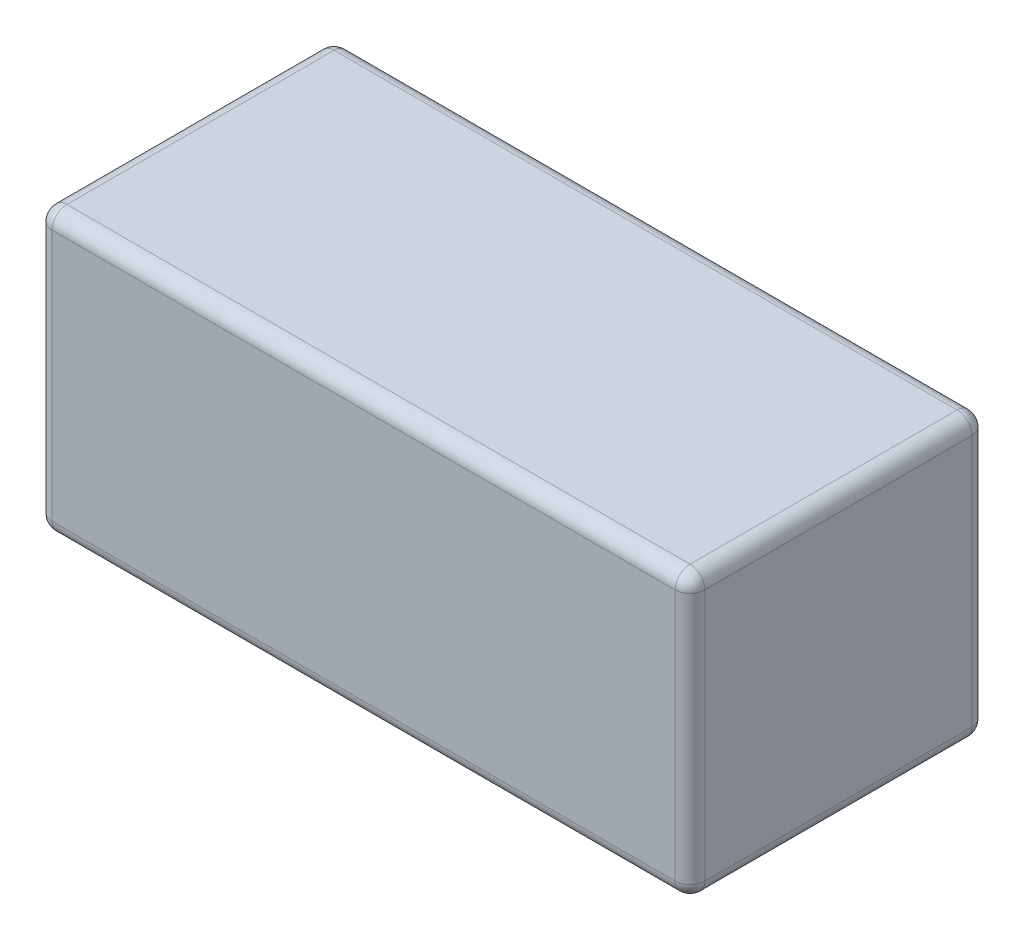
ISO-10303-21;
HEADER;
FILE_DESCRIPTION(('STEP AP214'),'2;1');
FILE_NAME('part.step','',(''),(''),'','','');
FILE_SCHEMA(('AUTOMOTIVE_DESIGN { 1 0 10303 214 1 1 1 1 }'));
ENDSEC;
DATA;
#1=APPLICATION_CONTEXT('core data for automotive mechanical design processes');
#2=APPLICATION_PROTOCOL_DEFINITION('international standard','automotive_design',2000,#1);
#3=PRODUCT_CONTEXT('',#1,'mechanical');
#4=PRODUCT('Part','Part','',(#3));
#5=PRODUCT_RELATED_PRODUCT_CATEGORY('part','',(#4));
#6=PRODUCT_DEFINITION_FORMATION('','',#4);
#7=PRODUCT_DEFINITION_CONTEXT('part definition',#1,'design');
#8=PRODUCT_DEFINITION('design','',#6,#7);
#9=PRODUCT_DEFINITION_SHAPE('','',#8);
#10=(LENGTH_UNIT() NAMED_UNIT(*) SI_UNIT(.MILLI.,.METRE.));
#11=(NAMED_UNIT(*) PLANE_ANGLE_UNIT() SI_UNIT($,.RADIAN.));
#12=(NAMED_UNIT(*) SI_UNIT($,.STERADIAN.) SOLID_ANGLE_UNIT());
#13=UNCERTAINTY_MEASURE_WITH_UNIT(LENGTH_MEASURE(1.E-05),#10,'distance_accuracy_value','');
#14=(GEOMETRIC_REPRESENTATION_CONTEXT(3) GLOBAL_UNCERTAINTY_ASSIGNED_CONTEXT((#13)) GLOBAL_UNIT_ASSIGNED_CONTEXT((#10,
#11,#12)) REPRESENTATION_CONTEXT('',''));
#15=CARTESIAN_POINT('',(0.,0.,0.));
#16=DIRECTION('',(0.,0.,1.));
#17=DIRECTION('',(1.,0.,0.));
#18=AXIS2_PLACEMENT_3D('',#15,#16,#17);
#19=CARTESIAN_POINT('',(11.,4.75,0.));
#20=DIRECTION('',(0.,1.,0.));
#21=DIRECTION('',(1.,0.,0.));
#22=AXIS2_PLACEMENT_3D('',#19,#20,#21);
#23=PLANE('',#22);
#24=DIRECTION('',(1.,0.,0.));
#25=VECTOR('',#24,1.);
#26=CARTESIAN_POINT('',(5.5,4.75,0.5));
#27=LINE('',#26,#25);
#28=CARTESIAN_POINT('',(-10.5,4.75,0.5));
#29=VERTEX_POINT('',#28);
#30=CARTESIAN_POINT('',(10.5,4.75,0.5));
#31=VERTEX_POINT('',#30);
#32=EDGE_CURVE('E280',#29,#31,#27,.T.);
#33=ORIENTED_EDGE('',*,*,#32,.F.);
#34=DIRECTION('',(0.,0.,-1.));
#35=VECTOR('',#34,1.);
#36=CARTESIAN_POINT('',(-10.5,4.75,0.));
#37=LINE('',#36,#35);
#38=CARTESIAN_POINT('',(-10.5,4.75,9.5));
#39=VERTEX_POINT('',#38);
#40=EDGE_CURVE('E11',#39,#29,#37,.T.);
#41=ORIENTED_EDGE('',*,*,#40,.F.);
#42=DIRECTION('',(-1.,0.,0.));
#43=VECTOR('',#42,1.);
#44=CARTESIAN_POINT('',(5.5,4.75,9.5));
#45=LINE('',#44,#43);
#46=CARTESIAN_POINT('',(10.5,4.75,9.5));
#47=VERTEX_POINT('',#46);
#48=EDGE_CURVE('E171',#47,#39,#45,.T.);
#49=ORIENTED_EDGE('',*,*,#48,.F.);
#50=DIRECTION('',(0.,0.,1.));
#51=VECTOR('',#50,1.);
#52=CARTESIAN_POINT('',(10.5,4.75,0.));
#53=LINE('',#52,#51);
#54=EDGE_CURVE('E183',#31,#47,#53,.T.);
#55=ORIENTED_EDGE('',*,*,#54,.F.);
#56=EDGE_LOOP('',(#33,#41,#49,#55));
#57=FACE_BOUND('',#56,.T.);
#58=ADVANCED_FACE('F17',(#57),#23,.T.);
#59=CARTESIAN_POINT('',(-10.5,4.25,0.));
#60=DIRECTION('',(0.,0.,1.));
#61=DIRECTION('',(-0.707106781186548,0.707106781186548,0.));
#62=AXIS2_PLACEMENT_3D('',#59,#60,#61);
#63=CYLINDRICAL_SURFACE('',#62,0.5);
#64=CARTESIAN_POINT('',(-10.5,4.25,0.5));
#65=DIRECTION('',(0.,0.,-1.));
#66=DIRECTION('',(-0.707106781186548,0.707106781186548,0.));
#67=AXIS2_PLACEMENT_3D('',#64,#65,#66);
#68=CIRCLE('',#67,0.5);
#69=CARTESIAN_POINT('',(-11.,4.25,0.5));
#70=VERTEX_POINT('',#69);
#71=EDGE_CURVE('E284',#70,#29,#68,.T.);
#72=ORIENTED_EDGE('',*,*,#71,.F.);
#73=DIRECTION('',(0.,0.,1.));
#74=VECTOR('',#73,1.);
#75=CARTESIAN_POINT('',(-11.,4.25,0.));
#76=LINE('',#75,#74);
#77=CARTESIAN_POINT('',(-11.,4.25,9.5));
#78=VERTEX_POINT('',#77);
#79=EDGE_CURVE('E28',#70,#78,#76,.T.);
#80=ORIENTED_EDGE('',*,*,#79,.T.);
#81=CARTESIAN_POINT('',(-10.5,4.25,9.5));
#82=DIRECTION('',(0.,0.,1.));
#83=DIRECTION('',(-0.707106781186548,0.707106781186548,0.));
#84=AXIS2_PLACEMENT_3D('',#81,#82,#83);
#85=CIRCLE('',#84,0.5);
#86=EDGE_CURVE('E166',#39,#78,#85,.T.);
#87=ORIENTED_EDGE('',*,*,#86,.F.);
#88=ORIENTED_EDGE('',*,*,#40,.T.);
#89=EDGE_LOOP('',(#72,#80,#87,#88));
#90=FACE_BOUND('',#89,.T.);
#91=ADVANCED_FACE('F349',(#90),#63,.T.);
#92=CARTESIAN_POINT('',(-11.,4.75,0.));
#93=DIRECTION('',(-1.,0.,0.));
#94=DIRECTION('',(0.,0.,1.));
#95=AXIS2_PLACEMENT_3D('',#92,#93,#94);
#96=PLANE('',#95);
#97=DIRECTION('',(0.,1.,0.));
#98=VECTOR('',#97,1.);
#99=CARTESIAN_POINT('',(-11.,2.375,0.5));
#100=LINE('',#99,#98);
#101=CARTESIAN_POINT('',(-11.,-4.25,0.5));
#102=VERTEX_POINT('',#101);
#103=EDGE_CURVE('E209',#102,#70,#100,.T.);
#104=ORIENTED_EDGE('',*,*,#103,.F.);
#105=DIRECTION('',(0.,0.,-1.));
#106=VECTOR('',#105,1.);
#107=CARTESIAN_POINT('',(-11.,-4.25,0.));
#108=LINE('',#107,#106);
#109=CARTESIAN_POINT('',(-11.,-4.25,9.5));
#110=VERTEX_POINT('',#109);
#111=EDGE_CURVE('E240',#110,#102,#108,.T.);
#112=ORIENTED_EDGE('',*,*,#111,.F.);
#113=DIRECTION('',(0.,-1.,0.));
#114=VECTOR('',#113,1.);
#115=CARTESIAN_POINT('',(-11.,2.375,9.5));
#116=LINE('',#115,#114);
#117=EDGE_CURVE('E228',#78,#110,#116,.T.);
#118=ORIENTED_EDGE('',*,*,#117,.F.);
#119=ORIENTED_EDGE('',*,*,#79,.F.);
#120=EDGE_LOOP('',(#104,#112,#118,#119));
#121=FACE_BOUND('',#120,.T.);
#122=ADVANCED_FACE('F369',(#121),#96,.T.);
#123=CARTESIAN_POINT('',(0.,0.,10.));
#124=DIRECTION('',(0.,0.,1.));
#125=DIRECTION('',(1.,0.,0.));
#126=AXIS2_PLACEMENT_3D('',#123,#124,#125);
#127=PLANE('',#126);
#128=DIRECTION('',(0.,1.,0.));
#129=VECTOR('',#128,1.);
#130=CARTESIAN_POINT('',(-10.5,2.375,10.));
#131=LINE('',#130,#129);
#132=CARTESIAN_POINT('',(-10.5,-4.25,10.));
#133=VERTEX_POINT('',#132);
#134=CARTESIAN_POINT('',(-10.5,4.25,10.));
#135=VERTEX_POINT('',#134);
#136=EDGE_CURVE('E172',#133,#135,#131,.T.);
#137=ORIENTED_EDGE('',*,*,#136,.F.);
#138=DIRECTION('',(-1.,0.,0.));
#139=VECTOR('',#138,1.);
#140=CARTESIAN_POINT('',(-5.5,-4.25,10.));
#141=LINE('',#140,#139);
#142=CARTESIAN_POINT('',(10.5,-4.25,10.));
#143=VERTEX_POINT('',#142);
#144=EDGE_CURVE('E21',#143,#133,#141,.T.);
#145=ORIENTED_EDGE('',*,*,#144,.F.);
#146=DIRECTION('',(0.,-1.,0.));
#147=VECTOR('',#146,1.);
#148=CARTESIAN_POINT('',(10.5,-2.375,10.));
#149=LINE('',#148,#147);
#150=CARTESIAN_POINT('',(10.5,4.25,10.));
#151=VERTEX_POINT('',#150);
#152=EDGE_CURVE('E133',#151,#143,#149,.T.);
#153=ORIENTED_EDGE('',*,*,#152,.F.);
#154=DIRECTION('',(1.,0.,0.));
#155=VECTOR('',#154,1.);
#156=CARTESIAN_POINT('',(5.5,4.25,10.));
#157=LINE('',#156,#155);
#158=EDGE_CURVE('E137',#135,#151,#157,.T.);
#159=ORIENTED_EDGE('',*,*,#158,.F.);
#160=EDGE_LOOP('',(#137,#145,#153,#159));
#161=FACE_BOUND('',#160,.T.);
#162=ADVANCED_FACE('F135',(#161),#127,.T.);
#163=CARTESIAN_POINT('',(10.5,4.25,0.));
#164=DIRECTION('',(0.,0.,1.));
#165=DIRECTION('',(0.707106781186548,0.707106781186548,0.));
#166=AXIS2_PLACEMENT_3D('',#163,#164,#165);
#167=CYLINDRICAL_SURFACE('',#166,0.5);
#168=CARTESIAN_POINT('',(10.5,4.25,0.5));
#169=DIRECTION('',(0.,0.,-1.));
#170=DIRECTION('',(0.707106781186548,0.707106781186548,0.));
#171=AXIS2_PLACEMENT_3D('',#168,#169,#170);
#172=CIRCLE('',#171,0.5);
#173=CARTESIAN_POINT('',(11.,4.25,0.5));
#174=VERTEX_POINT('',#173);
#175=EDGE_CURVE('E217',#31,#174,#172,.T.);
#176=ORIENTED_EDGE('',*,*,#175,.F.);
#177=ORIENTED_EDGE('',*,*,#54,.T.);
#178=CARTESIAN_POINT('',(10.5,4.25,9.5));
#179=DIRECTION('',(0.,0.,1.));
#180=DIRECTION('',(0.707106781186548,0.707106781186548,0.));
#181=AXIS2_PLACEMENT_3D('',#178,#179,#180);
#182=CIRCLE('',#181,0.5);
#183=CARTESIAN_POINT('',(11.,4.25,9.5));
#184=VERTEX_POINT('',#183);
#185=EDGE_CURVE('E142',#184,#47,#182,.T.);
#186=ORIENTED_EDGE('',*,*,#185,.F.);
#187=DIRECTION('',(0.,0.,-1.));
#188=VECTOR('',#187,1.);
#189=CARTESIAN_POINT('',(11.,4.25,0.));
#190=LINE('',#189,#188);
#191=EDGE_CURVE('E197',#184,#174,#190,.T.);
#192=ORIENTED_EDGE('',*,*,#191,.T.);
#193=EDGE_LOOP('',(#176,#177,#186,#192));
#194=FACE_BOUND('',#193,.T.);
#195=ADVANCED_FACE('F352',(#194),#167,.T.);
#196=CARTESIAN_POINT('',(-10.5,-4.25,9.5));
#197=DIRECTION('',(0.408248290463863,-0.816496580927726,-0.408248290463863));
#198=DIRECTION('',(-0.577350269189626,-0.577350269189626,0.577350269189626));
#199=AXIS2_PLACEMENT_3D('',#196,#197,#198);
#200=SPHERICAL_SURFACE('',#199,0.5);
#201=CARTESIAN_POINT('',(-10.5,-4.25,9.5));
#202=DIRECTION('',(0.,1.,0.));
#203=DIRECTION('',(-1.,0.,0.));
#204=AXIS2_PLACEMENT_3D('',#201,#202,#203);
#205=CIRCLE('',#204,0.5);
#206=EDGE_CURVE('E180',#110,#133,#205,.T.);
#207=ORIENTED_EDGE('',*,*,#206,.F.);
#208=CARTESIAN_POINT('',(-10.5,-4.25,9.5));
#209=DIRECTION('',(0.,0.,1.));
#210=DIRECTION('',(-0.707106781186548,-0.707106781186548,0.));
#211=AXIS2_PLACEMENT_3D('',#208,#209,#210);
#212=CIRCLE('',#211,0.5);
#213=CARTESIAN_POINT('',(-10.5,-4.75,9.5));
#214=VERTEX_POINT('',#213);
#215=EDGE_CURVE('E216',#110,#214,#212,.T.);
#216=ORIENTED_EDGE('',*,*,#215,.T.);
#217=CARTESIAN_POINT('',(-10.5,-4.25,9.5));
#218=DIRECTION('',(1.,0.,0.));
#219=DIRECTION('',(0.,0.,1.));
#220=AXIS2_PLACEMENT_3D('',#217,#218,#219);
#221=CIRCLE('',#220,0.5);
#222=EDGE_CURVE('E255',#133,#214,#221,.T.);
#223=ORIENTED_EDGE('',*,*,#222,.F.);
#224=EDGE_LOOP('',(#207,#216,#223));
#225=FACE_BOUND('',#224,.T.);
#226=ADVANCED_FACE('F415',(#225),#200,.T.);
#227=CARTESIAN_POINT('',(10.5,-4.25,9.5));
#228=DIRECTION('',(-0.408248290463863,-0.816496580927726,-0.408248290463863));
#229=DIRECTION('',(0.577350269189626,-0.577350269189626,0.577350269189626));
#230=AXIS2_PLACEMENT_3D('',#227,#228,#229);
#231=SPHERICAL_SURFACE('',#230,0.5);
#232=CARTESIAN_POINT('',(10.5,-4.25,9.5));
#233=DIRECTION('',(-1.,0.,0.));
#234=DIRECTION('',(0.,-1.,0.));
#235=AXIS2_PLACEMENT_3D('',#232,#233,#234);
#236=CIRCLE('',#235,0.5);
#237=CARTESIAN_POINT('',(10.5,-4.75,9.5));
#238=VERTEX_POINT('',#237);
#239=EDGE_CURVE('E265',#238,#143,#236,.T.);
#240=ORIENTED_EDGE('',*,*,#239,.F.);
#241=CARTESIAN_POINT('',(10.5,-4.25,9.5));
#242=DIRECTION('',(0.,0.,1.));
#243=DIRECTION('',(0.707106781186548,-0.707106781186548,0.));
#244=AXIS2_PLACEMENT_3D('',#241,#242,#243);
#245=CIRCLE('',#244,0.5);
#246=CARTESIAN_POINT('',(11.,-4.25,9.5));
#247=VERTEX_POINT('',#246);
#248=EDGE_CURVE('E193',#238,#247,#245,.T.);
#249=ORIENTED_EDGE('',*,*,#248,.T.);
#250=CARTESIAN_POINT('',(10.5,-4.25,9.5));
#251=DIRECTION('',(0.,1.,0.));
#252=DIRECTION('',(0.,0.,1.));
#253=AXIS2_PLACEMENT_3D('',#250,#251,#252);
#254=CIRCLE('',#253,0.5);
#255=EDGE_CURVE('E155',#143,#247,#254,.T.);
#256=ORIENTED_EDGE('',*,*,#255,.F.);
#257=EDGE_LOOP('',(#240,#249,#256));
#258=FACE_BOUND('',#257,.T.);
#259=ADVANCED_FACE('F410',(#258),#231,.T.);
#260=CARTESIAN_POINT('',(-5.5,-4.25,9.5));
#261=DIRECTION('',(1.,0.,0.));
#262=DIRECTION('',(0.,-0.707106781186548,0.707106781186548));
#263=AXIS2_PLACEMENT_3D('',#260,#261,#262);
#264=CYLINDRICAL_SURFACE('',#263,0.5);
#265=ORIENTED_EDGE('',*,*,#222,.T.);
#266=DIRECTION('',(1.,0.,0.));
#267=VECTOR('',#266,1.);
#268=CARTESIAN_POINT('',(-5.5,-4.75,9.5));
#269=LINE('',#268,#267);
#270=EDGE_CURVE('E239',#214,#238,#269,.T.);
#271=ORIENTED_EDGE('',*,*,#270,.T.);
#272=ORIENTED_EDGE('',*,*,#239,.T.);
#273=ORIENTED_EDGE('',*,*,#144,.T.);
#274=EDGE_LOOP('',(#265,#271,#272,#273));
#275=FACE_BOUND('',#274,.T.);
#276=ADVANCED_FACE('F406',(#275),#264,.T.);
#277=CARTESIAN_POINT('',(10.5,4.25,9.5));
#278=DIRECTION('',(0.408248290463863,-0.816496580927726,0.408248290463863));
#279=DIRECTION('',(0.577350269189626,0.577350269189626,0.577350269189626));
#280=AXIS2_PLACEMENT_3D('',#277,#278,#279);
#281=SPHERICAL_SURFACE('',#280,0.5);
#282=CARTESIAN_POINT('',(10.5,4.25,9.5));
#283=DIRECTION('',(0.,-1.,0.));
#284=DIRECTION('',(1.,0.,0.));
#285=AXIS2_PLACEMENT_3D('',#282,#283,#284);
#286=CIRCLE('',#285,0.5);
#287=EDGE_CURVE('E143',#184,#151,#286,.T.);
#288=ORIENTED_EDGE('',*,*,#287,.F.);
#289=ORIENTED_EDGE('',*,*,#185,.T.);
#290=CARTESIAN_POINT('',(10.5,4.25,9.5));
#291=DIRECTION('',(-1.,0.,0.));
#292=DIRECTION('',(0.,0.,1.));
#293=AXIS2_PLACEMENT_3D('',#290,#291,#292);
#294=CIRCLE('',#293,0.5);
#295=EDGE_CURVE('E161',#151,#47,#294,.T.);
#296=ORIENTED_EDGE('',*,*,#295,.F.);
#297=EDGE_LOOP('',(#288,#289,#296));
#298=FACE_BOUND('',#297,.T.);
#299=ADVANCED_FACE('F168',(#298),#281,.T.);
#300=CARTESIAN_POINT('',(10.5,-2.375,9.5));
#301=DIRECTION('',(0.,1.,0.));
#302=DIRECTION('',(0.707106781186548,0.,0.707106781186548));
#303=AXIS2_PLACEMENT_3D('',#300,#301,#302);
#304=CYLINDRICAL_SURFACE('',#303,0.5);
#305=ORIENTED_EDGE('',*,*,#255,.T.);
#306=DIRECTION('',(0.,1.,0.));
#307=VECTOR('',#306,1.);
#308=CARTESIAN_POINT('',(11.,-2.375,9.5));
#309=LINE('',#308,#307);
#310=EDGE_CURVE('E149',#247,#184,#309,.T.);
#311=ORIENTED_EDGE('',*,*,#310,.T.);
#312=ORIENTED_EDGE('',*,*,#287,.T.);
#313=ORIENTED_EDGE('',*,*,#152,.T.);
#314=EDGE_LOOP('',(#305,#311,#312,#313));
#315=FACE_BOUND('',#314,.T.);
#316=ADVANCED_FACE('F147',(#315),#304,.T.);
#317=CARTESIAN_POINT('',(-10.5,4.25,9.5));
#318=DIRECTION('',(-0.408248290463863,-0.816496580927726,0.408248290463863));
#319=DIRECTION('',(-0.577350269189626,0.577350269189626,0.577350269189626));
#320=AXIS2_PLACEMENT_3D('',#317,#318,#319);
#321=SPHERICAL_SURFACE('',#320,0.5);
#322=CARTESIAN_POINT('',(-10.5,4.25,9.5));
#323=DIRECTION('',(1.,0.,0.));
#324=DIRECTION('',(0.,1.,0.));
#325=AXIS2_PLACEMENT_3D('',#322,#323,#324);
#326=CIRCLE('',#325,0.5);
#327=EDGE_CURVE('E163',#39,#135,#326,.T.);
#328=ORIENTED_EDGE('',*,*,#327,.F.);
#329=ORIENTED_EDGE('',*,*,#86,.T.);
#330=CARTESIAN_POINT('',(-10.5,4.25,9.5));
#331=DIRECTION('',(0.,-1.,0.));
#332=DIRECTION('',(0.,0.,1.));
#333=AXIS2_PLACEMENT_3D('',#330,#331,#332);
#334=CIRCLE('',#333,0.5);
#335=EDGE_CURVE('E244',#135,#78,#334,.T.);
#336=ORIENTED_EDGE('',*,*,#335,.F.);
#337=EDGE_LOOP('',(#328,#329,#336));
#338=FACE_BOUND('',#337,.T.);
#339=ADVANCED_FACE('F376',(#338),#321,.T.);
#340=CARTESIAN_POINT('',(5.5,4.25,9.5));
#341=DIRECTION('',(-1.,0.,0.));
#342=DIRECTION('',(0.,0.707106781186548,0.707106781186548));
#343=AXIS2_PLACEMENT_3D('',#340,#341,#342);
#344=CYLINDRICAL_SURFACE('',#343,0.5);
#345=ORIENTED_EDGE('',*,*,#295,.T.);
#346=ORIENTED_EDGE('',*,*,#48,.T.);
#347=ORIENTED_EDGE('',*,*,#327,.T.);
#348=ORIENTED_EDGE('',*,*,#158,.T.);
#349=EDGE_LOOP('',(#345,#346,#347,#348));
#350=FACE_BOUND('',#349,.T.);
#351=ADVANCED_FACE('F159',(#350),#344,.T.);
#352=CARTESIAN_POINT('',(-10.5,2.375,9.5));
#353=DIRECTION('',(0.,-1.,0.));
#354=DIRECTION('',(-0.707106781186548,0.,0.707106781186548));
#355=AXIS2_PLACEMENT_3D('',#352,#353,#354);
#356=CYLINDRICAL_SURFACE('',#355,0.5);
#357=ORIENTED_EDGE('',*,*,#335,.T.);
#358=ORIENTED_EDGE('',*,*,#117,.T.);
#359=ORIENTED_EDGE('',*,*,#206,.T.);
#360=ORIENTED_EDGE('',*,*,#136,.T.);
#361=EDGE_LOOP('',(#357,#358,#359,#360));
#362=FACE_BOUND('',#361,.T.);
#363=ADVANCED_FACE('F374',(#362),#356,.T.);
#364=CARTESIAN_POINT('',(0.,0.,0.));
#365=DIRECTION('',(0.,0.,1.));
#366=DIRECTION('',(1.,0.,0.));
#367=AXIS2_PLACEMENT_3D('',#364,#365,#366);
#368=PLANE('',#367);
#369=DIRECTION('',(-1.,0.,0.));
#370=VECTOR('',#369,1.);
#371=CARTESIAN_POINT('',(5.5,4.25,0.));
#372=LINE('',#371,#370);
#373=CARTESIAN_POINT('',(10.5,4.25,0.));
#374=VERTEX_POINT('',#373);
#375=CARTESIAN_POINT('',(-10.5,4.25,0.));
#376=VERTEX_POINT('',#375);
#377=EDGE_CURVE('E192',#374,#376,#372,.T.);
#378=ORIENTED_EDGE('',*,*,#377,.F.);
#379=DIRECTION('',(0.,1.,0.));
#380=VECTOR('',#379,1.);
#381=CARTESIAN_POINT('',(10.5,-2.375,0.));
#382=LINE('',#381,#380);
#383=CARTESIAN_POINT('',(10.5,-4.25,0.));
#384=VERTEX_POINT('',#383);
#385=EDGE_CURVE('E288',#384,#374,#382,.T.);
#386=ORIENTED_EDGE('',*,*,#385,.F.);
#387=DIRECTION('',(1.,0.,0.));
#388=VECTOR('',#387,1.);
#389=CARTESIAN_POINT('',(-5.5,-4.25,0.));
#390=LINE('',#389,#388);
#391=CARTESIAN_POINT('',(-10.5,-4.25,0.));
#392=VERTEX_POINT('',#391);
#393=EDGE_CURVE('E219',#392,#384,#390,.T.);
#394=ORIENTED_EDGE('',*,*,#393,.F.);
#395=DIRECTION('',(0.,-1.,0.));
#396=VECTOR('',#395,1.);
#397=CARTESIAN_POINT('',(-10.5,2.375,0.));
#398=LINE('',#397,#396);
#399=EDGE_CURVE('E210',#376,#392,#398,.T.);
#400=ORIENTED_EDGE('',*,*,#399,.F.);
#401=EDGE_LOOP('',(#378,#386,#394,#400));
#402=FACE_BOUND('',#401,.T.);
#403=ADVANCED_FACE('F341',(#402),#368,.F.);
#404=CARTESIAN_POINT('',(11.,-4.75,0.));
#405=DIRECTION('',(1.,0.,0.));
#406=DIRECTION('',(0.,1.,0.));
#407=AXIS2_PLACEMENT_3D('',#404,#405,#406);
#408=PLANE('',#407);
#409=DIRECTION('',(0.,-1.,0.));
#410=VECTOR('',#409,1.);
#411=CARTESIAN_POINT('',(11.,-2.375,0.5));
#412=LINE('',#411,#410);
#413=CARTESIAN_POINT('',(11.,-4.25,0.5));
#414=VERTEX_POINT('',#413);
#415=EDGE_CURVE('E199',#174,#414,#412,.T.);
#416=ORIENTED_EDGE('',*,*,#415,.F.);
#417=ORIENTED_EDGE('',*,*,#191,.F.);
#418=ORIENTED_EDGE('',*,*,#310,.F.);
#419=DIRECTION('',(0.,0.,1.));
#420=VECTOR('',#419,1.);
#421=CARTESIAN_POINT('',(11.,-4.25,0.));
#422=LINE('',#421,#420);
#423=EDGE_CURVE('E198',#414,#247,#422,.T.);
#424=ORIENTED_EDGE('',*,*,#423,.F.);
#425=EDGE_LOOP('',(#416,#417,#418,#424));
#426=FACE_BOUND('',#425,.T.);
#427=ADVANCED_FACE('F354',(#426),#408,.T.);
#428=CARTESIAN_POINT('',(10.5,-4.25,0.));
#429=DIRECTION('',(0.,0.,1.));
#430=DIRECTION('',(0.707106781186548,-0.707106781186548,0.));
#431=AXIS2_PLACEMENT_3D('',#428,#429,#430);
#432=CYLINDRICAL_SURFACE('',#431,0.5);
#433=CARTESIAN_POINT('',(10.5,-4.25,0.5));
#434=DIRECTION('',(0.,0.,-1.));
#435=DIRECTION('',(0.707106781186548,-0.707106781186548,0.));
#436=AXIS2_PLACEMENT_3D('',#433,#434,#435);
#437=CIRCLE('',#436,0.5);
#438=CARTESIAN_POINT('',(10.5,-4.75,0.5));
#439=VERTEX_POINT('',#438);
#440=EDGE_CURVE('E203',#414,#439,#437,.T.);
#441=ORIENTED_EDGE('',*,*,#440,.F.);
#442=ORIENTED_EDGE('',*,*,#423,.T.);
#443=ORIENTED_EDGE('',*,*,#248,.F.);
#444=DIRECTION('',(0.,0.,-1.));
#445=VECTOR('',#444,1.);
#446=CARTESIAN_POINT('',(10.5,-4.75,0.));
#447=LINE('',#446,#445);
#448=EDGE_CURVE('E236',#238,#439,#447,.T.);
#449=ORIENTED_EDGE('',*,*,#448,.T.);
#450=EDGE_LOOP('',(#441,#442,#443,#449));
#451=FACE_BOUND('',#450,.T.);
#452=ADVANCED_FACE('F397',(#451),#432,.T.);
#453=CARTESIAN_POINT('',(-11.,-4.75,0.));
#454=DIRECTION('',(0.,-1.,0.));
#455=DIRECTION('',(0.,0.,-1.));
#456=AXIS2_PLACEMENT_3D('',#453,#454,#455);
#457=PLANE('',#456);
#458=DIRECTION('',(-1.,0.,0.));
#459=VECTOR('',#458,1.);
#460=CARTESIAN_POINT('',(-5.5,-4.75,0.5));
#461=LINE('',#460,#459);
#462=CARTESIAN_POINT('',(-10.5,-4.75,0.5));
#463=VERTEX_POINT('',#462);
#464=EDGE_CURVE('E231',#439,#463,#461,.T.);
#465=ORIENTED_EDGE('',*,*,#464,.F.);
#466=ORIENTED_EDGE('',*,*,#448,.F.);
#467=ORIENTED_EDGE('',*,*,#270,.F.);
#468=DIRECTION('',(0.,0.,1.));
#469=VECTOR('',#468,1.);
#470=CARTESIAN_POINT('',(-10.5,-4.75,0.));
#471=LINE('',#470,#469);
#472=EDGE_CURVE('E213',#463,#214,#471,.T.);
#473=ORIENTED_EDGE('',*,*,#472,.F.);
#474=EDGE_LOOP('',(#465,#466,#467,#473));
#475=FACE_BOUND('',#474,.T.);
#476=ADVANCED_FACE('F400',(#475),#457,.T.);
#477=CARTESIAN_POINT('',(-10.5,-4.25,0.));
#478=DIRECTION('',(0.,0.,1.));
#479=DIRECTION('',(-0.707106781186548,-0.707106781186548,0.));
#480=AXIS2_PLACEMENT_3D('',#477,#478,#479);
#481=CYLINDRICAL_SURFACE('',#480,0.5);
#482=CARTESIAN_POINT('',(-10.5,-4.25,0.5));
#483=DIRECTION('',(0.,0.,-1.));
#484=DIRECTION('',(-0.707106781186548,-0.707106781186548,0.));
#485=AXIS2_PLACEMENT_3D('',#482,#483,#484);
#486=CIRCLE('',#485,0.5);
#487=EDGE_CURVE('E235',#463,#102,#486,.T.);
#488=ORIENTED_EDGE('',*,*,#487,.F.);
#489=ORIENTED_EDGE('',*,*,#472,.T.);
#490=ORIENTED_EDGE('',*,*,#215,.F.);
#491=ORIENTED_EDGE('',*,*,#111,.T.);
#492=EDGE_LOOP('',(#488,#489,#490,#491));
#493=FACE_BOUND('',#492,.T.);
#494=ADVANCED_FACE('F423',(#493),#481,.T.);
#495=CARTESIAN_POINT('',(10.5,4.25,0.5));
#496=DIRECTION('',(0.408248290463863,-0.816496580927726,-0.408248290463863));
#497=DIRECTION('',(0.577350269189626,0.577350269189626,-0.577350269189626));
#498=AXIS2_PLACEMENT_3D('',#495,#496,#497);
#499=SPHERICAL_SURFACE('',#498,0.5);
#500=CARTESIAN_POINT('',(10.5,4.25,0.5));
#501=DIRECTION('',(-1.,0.,0.));
#502=DIRECTION('',(0.,1.,0.));
#503=AXIS2_PLACEMENT_3D('',#500,#501,#502);
#504=CIRCLE('',#503,0.5);
#505=EDGE_CURVE('E188',#31,#374,#504,.T.);
#506=ORIENTED_EDGE('',*,*,#505,.F.);
#507=ORIENTED_EDGE('',*,*,#175,.T.);
#508=CARTESIAN_POINT('',(10.5,4.25,0.5));
#509=DIRECTION('',(0.,-1.,0.));
#510=DIRECTION('',(0.,0.,-1.));
#511=AXIS2_PLACEMENT_3D('',#508,#509,#510);
#512=CIRCLE('',#511,0.5);
#513=EDGE_CURVE('E204',#374,#174,#512,.T.);
#514=ORIENTED_EDGE('',*,*,#513,.F.);
#515=EDGE_LOOP('',(#506,#507,#514));
#516=FACE_BOUND('',#515,.T.);
#517=ADVANCED_FACE('F332',(#516),#499,.T.);
#518=CARTESIAN_POINT('',(10.5,-4.25,0.5));
#519=DIRECTION('',(-0.408248290463863,-0.816496580927726,0.408248290463863));
#520=DIRECTION('',(0.577350269189626,-0.577350269189626,-0.577350269189626));
#521=AXIS2_PLACEMENT_3D('',#518,#519,#520);
#522=SPHERICAL_SURFACE('',#521,0.5);
#523=CARTESIAN_POINT('',(10.5,-4.25,0.5));
#524=DIRECTION('',(0.,1.,0.));
#525=DIRECTION('',(1.,0.,0.));
#526=AXIS2_PLACEMENT_3D('',#523,#524,#525);
#527=CIRCLE('',#526,0.5);
#528=EDGE_CURVE('E285',#414,#384,#527,.T.);
#529=ORIENTED_EDGE('',*,*,#528,.F.);
#530=ORIENTED_EDGE('',*,*,#440,.T.);
#531=CARTESIAN_POINT('',(10.5,-4.25,0.5));
#532=DIRECTION('',(-1.,0.,0.));
#533=DIRECTION('',(0.,0.,-1.));
#534=AXIS2_PLACEMENT_3D('',#531,#532,#533);
#535=CIRCLE('',#534,0.5);
#536=EDGE_CURVE('E223',#384,#439,#535,.T.);
#537=ORIENTED_EDGE('',*,*,#536,.F.);
#538=EDGE_LOOP('',(#529,#530,#537));
#539=FACE_BOUND('',#538,.T.);
#540=ADVANCED_FACE('F357',(#539),#522,.T.);
#541=CARTESIAN_POINT('',(10.5,-2.375,0.5));
#542=DIRECTION('',(0.,1.,0.));
#543=DIRECTION('',(0.707106781186548,0.,-0.707106781186548));
#544=AXIS2_PLACEMENT_3D('',#541,#542,#543);
#545=CYLINDRICAL_SURFACE('',#544,0.5);
#546=ORIENTED_EDGE('',*,*,#528,.T.);
#547=ORIENTED_EDGE('',*,*,#385,.T.);
#548=ORIENTED_EDGE('',*,*,#513,.T.);
#549=ORIENTED_EDGE('',*,*,#415,.T.);
#550=EDGE_LOOP('',(#546,#547,#548,#549));
#551=FACE_BOUND('',#550,.T.);
#552=ADVANCED_FACE('F337',(#551),#545,.T.);
#553=CARTESIAN_POINT('',(-10.5,-4.25,0.5));
#554=DIRECTION('',(0.408248290463863,-0.816496580927726,0.408248290463863));
#555=DIRECTION('',(-0.577350269189626,-0.577350269189626,-0.577350269189626));
#556=AXIS2_PLACEMENT_3D('',#553,#554,#555);
#557=SPHERICAL_SURFACE('',#556,0.5);
#558=CARTESIAN_POINT('',(-10.5,-4.25,0.5));
#559=DIRECTION('',(1.,0.,0.));
#560=DIRECTION('',(0.,-1.,0.));
#561=AXIS2_PLACEMENT_3D('',#558,#559,#560);
#562=CIRCLE('',#561,0.5);
#563=EDGE_CURVE('E224',#463,#392,#562,.T.);
#564=ORIENTED_EDGE('',*,*,#563,.F.);
#565=ORIENTED_EDGE('',*,*,#487,.T.);
#566=CARTESIAN_POINT('',(-10.5,-4.25,0.5));
#567=DIRECTION('',(0.,1.,0.));
#568=DIRECTION('',(0.,0.,-1.));
#569=AXIS2_PLACEMENT_3D('',#566,#567,#568);
#570=CIRCLE('',#569,0.5);
#571=EDGE_CURVE('E205',#392,#102,#570,.T.);
#572=ORIENTED_EDGE('',*,*,#571,.F.);
#573=EDGE_LOOP('',(#564,#565,#572));
#574=FACE_BOUND('',#573,.T.);
#575=ADVANCED_FACE('F364',(#574),#557,.T.);
#576=CARTESIAN_POINT('',(-5.5,-4.25,0.5));
#577=DIRECTION('',(1.,0.,0.));
#578=DIRECTION('',(0.,-0.707106781186548,-0.707106781186548));
#579=AXIS2_PLACEMENT_3D('',#576,#577,#578);
#580=CYLINDRICAL_SURFACE('',#579,0.5);
#581=ORIENTED_EDGE('',*,*,#563,.T.);
#582=ORIENTED_EDGE('',*,*,#393,.T.);
#583=ORIENTED_EDGE('',*,*,#536,.T.);
#584=ORIENTED_EDGE('',*,*,#464,.T.);
#585=EDGE_LOOP('',(#581,#582,#583,#584));
#586=FACE_BOUND('',#585,.T.);
#587=ADVANCED_FACE('F360',(#586),#580,.T.);
#588=CARTESIAN_POINT('',(-10.5,4.25,0.5));
#589=DIRECTION('',(-0.408248290463863,-0.816496580927726,-0.408248290463863));
#590=DIRECTION('',(-0.577350269189626,0.577350269189626,-0.577350269189626));
#591=AXIS2_PLACEMENT_3D('',#588,#589,#590);
#592=SPHERICAL_SURFACE('',#591,0.5);
#593=CARTESIAN_POINT('',(-10.5,4.25,0.5));
#594=DIRECTION('',(0.,-1.,0.));
#595=DIRECTION('',(-1.,0.,0.));
#596=AXIS2_PLACEMENT_3D('',#593,#594,#595);
#597=CIRCLE('',#596,0.5);
#598=EDGE_CURVE('E306',#70,#376,#597,.T.);
#599=ORIENTED_EDGE('',*,*,#598,.F.);
#600=ORIENTED_EDGE('',*,*,#71,.T.);
#601=CARTESIAN_POINT('',(-10.5,4.25,0.5));
#602=DIRECTION('',(1.,0.,0.));
#603=DIRECTION('',(0.,0.,-1.));
#604=AXIS2_PLACEMENT_3D('',#601,#602,#603);
#605=CIRCLE('',#604,0.5);
#606=EDGE_CURVE('E262',#376,#29,#605,.T.);
#607=ORIENTED_EDGE('',*,*,#606,.F.);
#608=EDGE_LOOP('',(#599,#600,#607));
#609=FACE_BOUND('',#608,.T.);
#610=ADVANCED_FACE('F346',(#609),#592,.T.);
#611=CARTESIAN_POINT('',(-10.5,2.375,0.5));
#612=DIRECTION('',(0.,-1.,0.));
#613=DIRECTION('',(-0.707106781186548,0.,-0.707106781186548));
#614=AXIS2_PLACEMENT_3D('',#611,#612,#613);
#615=CYLINDRICAL_SURFACE('',#614,0.5);
#616=ORIENTED_EDGE('',*,*,#598,.T.);
#617=ORIENTED_EDGE('',*,*,#399,.T.);
#618=ORIENTED_EDGE('',*,*,#571,.T.);
#619=ORIENTED_EDGE('',*,*,#103,.T.);
#620=EDGE_LOOP('',(#616,#617,#618,#619));
#621=FACE_BOUND('',#620,.T.);
#622=ADVANCED_FACE('F19',(#621),#615,.T.);
#623=CARTESIAN_POINT('',(5.5,4.25,0.5));
#624=DIRECTION('',(-1.,0.,0.));
#625=DIRECTION('',(0.,0.707106781186548,-0.707106781186548));
#626=AXIS2_PLACEMENT_3D('',#623,#624,#625);
#627=CYLINDRICAL_SURFACE('',#626,0.5);
#628=ORIENTED_EDGE('',*,*,#505,.T.);
#629=ORIENTED_EDGE('',*,*,#377,.T.);
#630=ORIENTED_EDGE('',*,*,#606,.T.);
#631=ORIENTED_EDGE('',*,*,#32,.T.);
#632=EDGE_LOOP('',(#628,#629,#630,#631));
#633=FACE_BOUND('',#632,.T.);
#634=ADVANCED_FACE('F328',(#633),#627,.T.);
#635=CLOSED_SHELL('',(#58,#91,#122,#162,#195,#226,#259,#276,#299,#316,#339,#351,#363,#403,#427,
#452,#476,#494,#517,#540,#552,#575,#587,#610,#622,#634));
#636=MANIFOLD_SOLID_BREP('B1',#635);
#637=ADVANCED_BREP_SHAPE_REPRESENTATION('',(#18,#636),#14);
#638=SHAPE_DEFINITION_REPRESENTATION(#9,#637);
ENDSEC;
END-ISO-10303-21;
